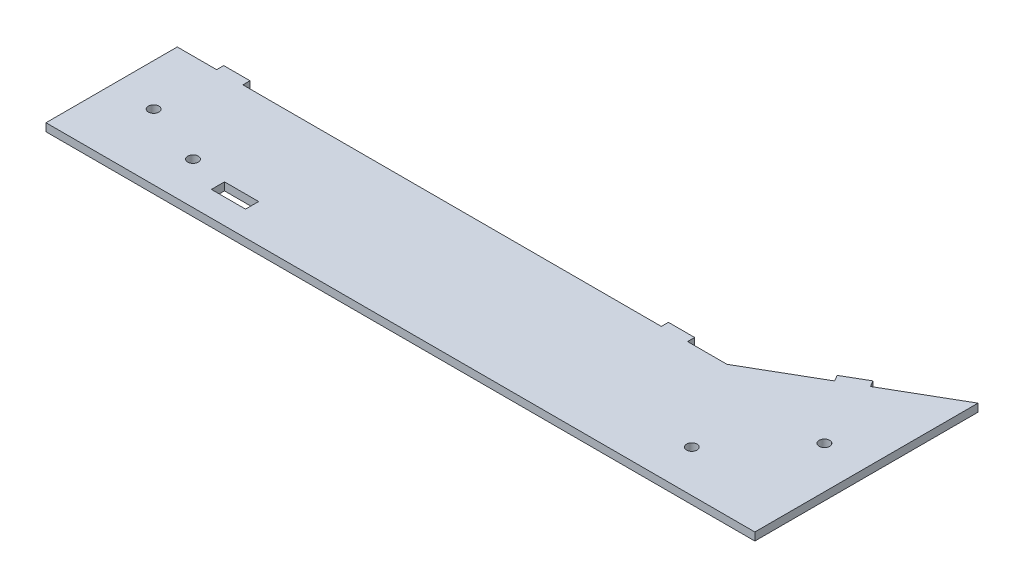
ISO-10303-21;
HEADER;
FILE_DESCRIPTION(('STEP AP214'),'2;1');
FILE_NAME('part.step','',(''),(''),'','','');
FILE_SCHEMA(('AUTOMOTIVE_DESIGN { 1 0 10303 214 1 1 1 1 }'));
ENDSEC;
DATA;
#1=APPLICATION_CONTEXT('core data for automotive mechanical design processes');
#2=APPLICATION_PROTOCOL_DEFINITION('international standard','automotive_design',2000,#1);
#3=PRODUCT_CONTEXT('',#1,'mechanical');
#4=PRODUCT('Part','Part','',(#3));
#5=PRODUCT_RELATED_PRODUCT_CATEGORY('part','',(#4));
#6=PRODUCT_DEFINITION_FORMATION('','',#4);
#7=PRODUCT_DEFINITION_CONTEXT('part definition',#1,'design');
#8=PRODUCT_DEFINITION('design','',#6,#7);
#9=PRODUCT_DEFINITION_SHAPE('','',#8);
#10=(LENGTH_UNIT() NAMED_UNIT(*) SI_UNIT(.MILLI.,.METRE.));
#11=(NAMED_UNIT(*) PLANE_ANGLE_UNIT() SI_UNIT($,.RADIAN.));
#12=(NAMED_UNIT(*) SI_UNIT($,.STERADIAN.) SOLID_ANGLE_UNIT());
#13=UNCERTAINTY_MEASURE_WITH_UNIT(LENGTH_MEASURE(1.E-05),#10,'distance_accuracy_value','');
#14=(GEOMETRIC_REPRESENTATION_CONTEXT(3) GLOBAL_UNCERTAINTY_ASSIGNED_CONTEXT((#13)) GLOBAL_UNIT_ASSIGNED_CONTEXT((#10,
#11,#12)) REPRESENTATION_CONTEXT('',''));
#15=CARTESIAN_POINT('',(0.,0.,0.));
#16=DIRECTION('',(0.,0.,1.));
#17=DIRECTION('',(1.,0.,0.));
#18=AXIS2_PLACEMENT_3D('',#15,#16,#17);
#19=CARTESIAN_POINT('',(101.124303581852,3.,-66.2732771144719));
#20=DIRECTION('',(0.500000000000001,0.,0.866025403784438));
#21=DIRECTION('',(0.866025403784438,0.,-0.500000000000001));
#22=AXIS2_PLACEMENT_3D('',#19,#20,#21);
#23=PLANE('',#22);
#24=DIRECTION('',(0.,-1.,0.));
#25=VECTOR('',#24,1.);
#26=CARTESIAN_POINT('',(75.1435414683194,3.,-51.2732771144718));
#27=LINE('',#26,#25);
#28=CARTESIAN_POINT('',(75.1435414683194,3.,-51.2732771144718));
#29=VERTEX_POINT('',#28);
#30=CARTESIAN_POINT('',(75.1435414683194,0.,-51.2732771144718));
#31=VERTEX_POINT('',#30);
#32=EDGE_CURVE('E189',#29,#31,#27,.T.);
#33=ORIENTED_EDGE('',*,*,#32,.F.);
#34=DIRECTION('',(-0.866025403784438,0.,0.500000000000001));
#35=VECTOR('',#34,1.);
#36=CARTESIAN_POINT('',(101.124303581852,3.,-66.2732771144719));
#37=LINE('',#36,#35);
#38=CARTESIAN_POINT('',(101.124303581852,3.,-66.2732771144719));
#39=VERTEX_POINT('',#38);
#40=EDGE_CURVE('E322',#39,#29,#37,.T.);
#41=ORIENTED_EDGE('',*,*,#40,.F.);
#42=DIRECTION('',(0.,-1.,0.));
#43=VECTOR('',#42,1.);
#44=CARTESIAN_POINT('',(101.124303581852,3.,-66.2732771144719));
#45=LINE('',#44,#43);
#46=CARTESIAN_POINT('',(101.124303581852,0.,-66.2732771144719));
#47=VERTEX_POINT('',#46);
#48=EDGE_CURVE('E339',#39,#47,#45,.T.);
#49=ORIENTED_EDGE('',*,*,#48,.T.);
#50=DIRECTION('',(-0.866025403784438,0.,0.500000000000001));
#51=VECTOR('',#50,1.);
#52=CARTESIAN_POINT('',(101.124303581852,0.,-66.2732771144719));
#53=LINE('',#52,#51);
#54=EDGE_CURVE('E340',#47,#31,#53,.T.);
#55=ORIENTED_EDGE('',*,*,#54,.T.);
#56=EDGE_LOOP('',(#33,#41,#49,#55));
#57=FACE_BOUND('',#56,.T.);
#58=ADVANCED_FACE('F33',(#57),#23,.F.);
#59=DIRECTION('',(0.,1.,0.));
#60=VECTOR('',#59,1.);
#61=CARTESIAN_POINT('',(66.483287430475,3.,-46.2732771144718));
#62=LINE('',#61,#60);
#63=CARTESIAN_POINT('',(66.483287430475,0.,-46.2732771144718));
#64=VERTEX_POINT('',#63);
#65=CARTESIAN_POINT('',(66.483287430475,3.,-46.2732771144718));
#66=VERTEX_POINT('',#65);
#67=EDGE_CURVE('E216',#64,#66,#62,.T.);
#68=ORIENTED_EDGE('',*,*,#67,.F.);
#69=CARTESIAN_POINT('',(40.5025253169418,0.,-31.2732771144718));
#70=VERTEX_POINT('',#69);
#71=EDGE_CURVE('E321',#64,#70,#53,.T.);
#72=ORIENTED_EDGE('',*,*,#71,.T.);
#73=DIRECTION('',(0.,-1.,0.));
#74=VECTOR('',#73,1.);
#75=CARTESIAN_POINT('',(40.5025253169418,3.,-31.2732771144718));
#76=LINE('',#75,#74);
#77=CARTESIAN_POINT('',(40.5025253169418,3.,-31.2732771144718));
#78=VERTEX_POINT('',#77);
#79=EDGE_CURVE('E11',#78,#70,#76,.T.);
#80=ORIENTED_EDGE('',*,*,#79,.F.);
#81=EDGE_CURVE('E326',#66,#78,#37,.T.);
#82=ORIENTED_EDGE('',*,*,#81,.F.);
#83=EDGE_LOOP('',(#68,#72,#80,#82));
#84=FACE_BOUND('',#83,.T.);
#85=ADVANCED_FACE('F397',(#84),#23,.F.);
#86=CARTESIAN_POINT('',(40.5025253169418,3.,-31.2732771144718));
#87=DIRECTION('',(0.,0.,1.));
#88=DIRECTION('',(1.,0.,0.));
#89=AXIS2_PLACEMENT_3D('',#86,#87,#88);
#90=PLANE('',#89);
#91=DIRECTION('',(-1.,0.,0.));
#92=VECTOR('',#91,1.);
#93=CARTESIAN_POINT('',(40.5025253169418,0.,-31.2732771144718));
#94=LINE('',#93,#92);
#95=CARTESIAN_POINT('',(25.5025253169418,0.,-31.2732771144718));
#96=VERTEX_POINT('',#95);
#97=EDGE_CURVE('E343',#70,#96,#94,.T.);
#98=ORIENTED_EDGE('',*,*,#97,.T.);
#99=DIRECTION('',(0.,1.,0.));
#100=VECTOR('',#99,1.);
#101=CARTESIAN_POINT('',(25.5025253169418,3.,-31.2732771144718));
#102=LINE('',#101,#100);
#103=CARTESIAN_POINT('',(25.5025253169418,3.,-31.2732771144718));
#104=VERTEX_POINT('',#103);
#105=EDGE_CURVE('E238',#96,#104,#102,.T.);
#106=ORIENTED_EDGE('',*,*,#105,.T.);
#107=DIRECTION('',(-1.,0.,0.));
#108=VECTOR('',#107,1.);
#109=CARTESIAN_POINT('',(40.5025253169418,3.,-31.2732771144718));
#110=LINE('',#109,#108);
#111=EDGE_CURVE('E327',#78,#104,#110,.T.);
#112=ORIENTED_EDGE('',*,*,#111,.F.);
#113=ORIENTED_EDGE('',*,*,#79,.T.);
#114=EDGE_LOOP('',(#98,#106,#112,#113));
#115=FACE_BOUND('',#114,.T.);
#116=ADVANCED_FACE('F401',(#115),#90,.F.);
#117=CARTESIAN_POINT('',(15.5025253169418,3.,-31.2732771144718));
#118=VERTEX_POINT('',#117);
#119=CARTESIAN_POINT('',(-143.875696418148,3.,-31.2732771144717));
#120=VERTEX_POINT('',#119);
#121=EDGE_CURVE('E331',#118,#120,#110,.T.);
#122=ORIENTED_EDGE('',*,*,#121,.F.);
#123=DIRECTION('',(0.,-1.,0.));
#124=VECTOR('',#123,1.);
#125=CARTESIAN_POINT('',(15.5025253169418,3.,-31.2732771144718));
#126=LINE('',#125,#124);
#127=CARTESIAN_POINT('',(15.5025253169418,0.,-31.2732771144718));
#128=VERTEX_POINT('',#127);
#129=EDGE_CURVE('E243',#118,#128,#126,.T.);
#130=ORIENTED_EDGE('',*,*,#129,.T.);
#131=CARTESIAN_POINT('',(-143.875696418148,0.,-31.2732771144717));
#132=VERTEX_POINT('',#131);
#133=EDGE_CURVE('E346',#128,#132,#94,.T.);
#134=ORIENTED_EDGE('',*,*,#133,.T.);
#135=DIRECTION('',(0.,1.,0.));
#136=VECTOR('',#135,1.);
#137=CARTESIAN_POINT('',(-143.875696418148,3.,-31.2732771144718));
#138=LINE('',#137,#136);
#139=EDGE_CURVE('E259',#132,#120,#138,.T.);
#140=ORIENTED_EDGE('',*,*,#139,.T.);
#141=EDGE_LOOP('',(#122,#130,#134,#140));
#142=FACE_BOUND('',#141,.T.);
#143=ADVANCED_FACE('F415',(#142),#90,.F.);
#144=CARTESIAN_POINT('',(-153.875696418148,3.,-31.2732771144717));
#145=VERTEX_POINT('',#144);
#146=CARTESIAN_POINT('',(-168.875696418148,3.,-31.2732771144717));
#147=VERTEX_POINT('',#146);
#148=EDGE_CURVE('E325',#145,#147,#110,.T.);
#149=ORIENTED_EDGE('',*,*,#148,.F.);
#150=DIRECTION('',(0.,-1.,0.));
#151=VECTOR('',#150,1.);
#152=CARTESIAN_POINT('',(-153.875696418148,3.,-31.2732771144718));
#153=LINE('',#152,#151);
#154=CARTESIAN_POINT('',(-153.875696418148,0.,-31.2732771144718));
#155=VERTEX_POINT('',#154);
#156=EDGE_CURVE('E272',#145,#155,#153,.T.);
#157=ORIENTED_EDGE('',*,*,#156,.T.);
#158=CARTESIAN_POINT('',(-168.875696418148,0.,-31.2732771144717));
#159=VERTEX_POINT('',#158);
#160=EDGE_CURVE('E342',#155,#159,#94,.T.);
#161=ORIENTED_EDGE('',*,*,#160,.T.);
#162=DIRECTION('',(0.,-1.,0.));
#163=VECTOR('',#162,1.);
#164=CARTESIAN_POINT('',(-168.875696418148,3.,-31.2732771144717));
#165=LINE('',#164,#163);
#166=EDGE_CURVE('E40',#147,#159,#165,.T.);
#167=ORIENTED_EDGE('',*,*,#166,.F.);
#168=EDGE_LOOP('',(#149,#157,#161,#167));
#169=FACE_BOUND('',#168,.T.);
#170=ADVANCED_FACE('F418',(#169),#90,.F.);
#171=CARTESIAN_POINT('',(-168.875696418148,3.,-31.2732771144717));
#172=DIRECTION('',(1.,0.,0.));
#173=DIRECTION('',(0.,0.,-1.));
#174=AXIS2_PLACEMENT_3D('',#171,#172,#173);
#175=PLANE('',#174);
#176=DIRECTION('',(0.,0.,1.));
#177=VECTOR('',#176,1.);
#178=CARTESIAN_POINT('',(-168.875696418148,0.,-31.2732771144717));
#179=LINE('',#178,#177);
#180=CARTESIAN_POINT('',(-168.875696418148,0.,18.7267228855283));
#181=VERTEX_POINT('',#180);
#182=EDGE_CURVE('E345',#159,#181,#179,.T.);
#183=ORIENTED_EDGE('',*,*,#182,.T.);
#184=DIRECTION('',(0.,-1.,0.));
#185=VECTOR('',#184,1.);
#186=CARTESIAN_POINT('',(-168.875696418148,3.,18.7267228855283));
#187=LINE('',#186,#185);
#188=CARTESIAN_POINT('',(-168.875696418148,3.,18.7267228855283));
#189=VERTEX_POINT('',#188);
#190=EDGE_CURVE('E359',#189,#181,#187,.T.);
#191=ORIENTED_EDGE('',*,*,#190,.F.);
#192=DIRECTION('',(0.,0.,1.));
#193=VECTOR('',#192,1.);
#194=CARTESIAN_POINT('',(-168.875696418148,3.,-31.2732771144717));
#195=LINE('',#194,#193);
#196=EDGE_CURVE('E330',#147,#189,#195,.T.);
#197=ORIENTED_EDGE('',*,*,#196,.F.);
#198=ORIENTED_EDGE('',*,*,#166,.T.);
#199=EDGE_LOOP('',(#183,#191,#197,#198));
#200=FACE_BOUND('',#199,.T.);
#201=ADVANCED_FACE('F365',(#200),#175,.F.);
#202=CARTESIAN_POINT('',(101.124303581852,3.,18.7267228855282));
#203=DIRECTION('',(0.,0.,1.));
#204=DIRECTION('',(1.,0.,0.));
#205=AXIS2_PLACEMENT_3D('',#202,#203,#204);
#206=PLANE('',#205);
#207=DIRECTION('',(-1.,0.,0.));
#208=VECTOR('',#207,1.);
#209=CARTESIAN_POINT('',(101.124303581852,0.,18.7267228855282));
#210=LINE('',#209,#208);
#211=CARTESIAN_POINT('',(101.124303581852,0.,18.7267228855282));
#212=VERTEX_POINT('',#211);
#213=EDGE_CURVE('E349',#212,#181,#210,.T.);
#214=ORIENTED_EDGE('',*,*,#213,.F.);
#215=DIRECTION('',(0.,-1.,0.));
#216=VECTOR('',#215,1.);
#217=CARTESIAN_POINT('',(101.124303581852,3.,18.7267228855282));
#218=LINE('',#217,#216);
#219=CARTESIAN_POINT('',(101.124303581852,3.,18.7267228855282));
#220=VERTEX_POINT('',#219);
#221=EDGE_CURVE('E356',#220,#212,#218,.T.);
#222=ORIENTED_EDGE('',*,*,#221,.F.);
#223=DIRECTION('',(-1.,0.,0.));
#224=VECTOR('',#223,1.);
#225=CARTESIAN_POINT('',(101.124303581852,3.,18.7267228855282));
#226=LINE('',#225,#224);
#227=EDGE_CURVE('E333',#220,#189,#226,.T.);
#228=ORIENTED_EDGE('',*,*,#227,.T.);
#229=ORIENTED_EDGE('',*,*,#190,.T.);
#230=EDGE_LOOP('',(#214,#222,#228,#229));
#231=FACE_BOUND('',#230,.T.);
#232=ADVANCED_FACE('F372',(#231),#206,.T.);
#233=CARTESIAN_POINT('',(101.124303581852,3.,-11.2137320546137));
#234=DIRECTION('',(-1.,0.,0.));
#235=DIRECTION('',(0.,0.,1.));
#236=AXIS2_PLACEMENT_3D('',#233,#234,#235);
#237=PLANE('',#236);
#238=DIRECTION('',(0.,0.,-1.));
#239=VECTOR('',#238,1.);
#240=CARTESIAN_POINT('',(101.124303581852,0.,-11.2137320546137));
#241=LINE('',#240,#239);
#242=EDGE_CURVE('E352',#212,#47,#241,.T.);
#243=ORIENTED_EDGE('',*,*,#242,.T.);
#244=ORIENTED_EDGE('',*,*,#48,.F.);
#245=DIRECTION('',(0.,0.,1.));
#246=VECTOR('',#245,1.);
#247=CARTESIAN_POINT('',(101.124303581852,3.,-11.2137320546137));
#248=LINE('',#247,#246);
#249=EDGE_CURVE('E336',#39,#220,#248,.T.);
#250=ORIENTED_EDGE('',*,*,#249,.T.);
#251=ORIENTED_EDGE('',*,*,#221,.T.);
#252=EDGE_LOOP('',(#243,#244,#250,#251));
#253=FACE_BOUND('',#252,.T.);
#254=ADVANCED_FACE('F378',(#253),#237,.F.);
#255=CARTESIAN_POINT('',(0.,3.,0.));
#256=DIRECTION('',(0.,1.,0.));
#257=DIRECTION('',(0.,0.,1.));
#258=AXIS2_PLACEMENT_3D('',#255,#256,#257);
#259=PLANE('',#258);
#260=DIRECTION('',(0.,0.,-1.));
#261=VECTOR('',#260,1.);
#262=CARTESIAN_POINT('',(-102.375696418148,3.,4.2267228855282));
#263=LINE('',#262,#261);
#264=CARTESIAN_POINT('',(-102.375696418148,3.,9.2267228855282));
#265=VERTEX_POINT('',#264);
#266=CARTESIAN_POINT('',(-102.375696418148,3.,4.2267228855282));
#267=VERTEX_POINT('',#266);
#268=EDGE_CURVE('E47',#265,#267,#263,.T.);
#269=ORIENTED_EDGE('',*,*,#268,.F.);
#270=DIRECTION('',(1.,0.,0.));
#271=VECTOR('',#270,1.);
#272=CARTESIAN_POINT('',(-115.375696418148,3.,9.2267228855282));
#273=LINE('',#272,#271);
#274=CARTESIAN_POINT('',(-115.375696418148,3.,9.2267228855282));
#275=VERTEX_POINT('',#274);
#276=EDGE_CURVE('E183',#275,#265,#273,.T.);
#277=ORIENTED_EDGE('',*,*,#276,.F.);
#278=DIRECTION('',(0.,0.,1.));
#279=VECTOR('',#278,1.);
#280=CARTESIAN_POINT('',(-115.375696418148,3.,4.2267228855282));
#281=LINE('',#280,#279);
#282=CARTESIAN_POINT('',(-115.375696418148,3.,4.2267228855282));
#283=VERTEX_POINT('',#282);
#284=EDGE_CURVE('E203',#283,#275,#281,.T.);
#285=ORIENTED_EDGE('',*,*,#284,.F.);
#286=DIRECTION('',(-1.,0.,0.));
#287=VECTOR('',#286,1.);
#288=CARTESIAN_POINT('',(-115.375696418148,3.,4.2267228855282));
#289=LINE('',#288,#287);
#290=EDGE_CURVE('E197',#267,#283,#289,.T.);
#291=ORIENTED_EDGE('',*,*,#290,.F.);
#292=EDGE_LOOP('',(#269,#277,#285,#291));
#293=FACE_BOUND('',#292,.T.);
#294=CARTESIAN_POINT('',(61.1243035818525,3.,2.7267228855282));
#295=DIRECTION('',(0.,1.,0.));
#296=DIRECTION('',(0.,0.,1.));
#297=AXIS2_PLACEMENT_3D('',#294,#295,#296);
#298=CIRCLE('',#297,1.99999999999999);
#299=CARTESIAN_POINT('',(61.1243035818525,3.,4.72672288552819));
#300=VERTEX_POINT('',#299);
#301=EDGE_CURVE('E289',#300,#300,#298,.T.);
#302=ORIENTED_EDGE('',*,*,#301,.F.);
#303=EDGE_LOOP('',(#302));
#304=FACE_BOUND('',#303,.T.);
#305=CARTESIAN_POINT('',(-128.875696418148,3.,2.7267228855282));
#306=DIRECTION('',(0.,1.,0.));
#307=DIRECTION('',(0.,0.,1.));
#308=AXIS2_PLACEMENT_3D('',#305,#306,#307);
#309=CIRCLE('',#308,2.);
#310=CARTESIAN_POINT('',(-128.875696418148,3.,4.7267228855282));
#311=VERTEX_POINT('',#310);
#312=EDGE_CURVE('E303',#311,#311,#309,.T.);
#313=ORIENTED_EDGE('',*,*,#312,.F.);
#314=EDGE_LOOP('',(#313));
#315=FACE_BOUND('',#314,.T.);
#316=CARTESIAN_POINT('',(85.1243035818525,3.,-23.7732771144718));
#317=DIRECTION('',(0.,1.,0.));
#318=DIRECTION('',(0.,0.,1.));
#319=AXIS2_PLACEMENT_3D('',#316,#317,#318);
#320=CIRCLE('',#319,2.);
#321=CARTESIAN_POINT('',(85.1243035818525,3.,-21.7732771144718));
#322=VERTEX_POINT('',#321);
#323=EDGE_CURVE('E312',#322,#322,#320,.T.);
#324=ORIENTED_EDGE('',*,*,#323,.F.);
#325=EDGE_LOOP('',(#324));
#326=FACE_BOUND('',#325,.T.);
#327=CARTESIAN_POINT('',(-152.875696418148,3.,-6.27327711447171));
#328=DIRECTION('',(0.,1.,0.));
#329=DIRECTION('',(0.,0.,1.));
#330=AXIS2_PLACEMENT_3D('',#327,#328,#329);
#331=CIRCLE('',#330,2.);
#332=CARTESIAN_POINT('',(-152.875696418148,3.,-4.27327711447172));
#333=VERTEX_POINT('',#332);
#334=EDGE_CURVE('E315',#333,#333,#331,.T.);
#335=ORIENTED_EDGE('',*,*,#334,.F.);
#336=EDGE_LOOP('',(#335));
#337=FACE_BOUND('',#336,.T.);
#338=ORIENTED_EDGE('',*,*,#40,.T.);
#339=DIRECTION('',(0.500000000000001,0.,0.866025403784438));
#340=VECTOR('',#339,1.);
#341=CARTESIAN_POINT('',(73.7935414683194,3.,-53.6115457046898));
#342=LINE('',#341,#340);
#343=CARTESIAN_POINT('',(73.7935414683194,3.,-53.6115457046898));
#344=VERTEX_POINT('',#343);
#345=EDGE_CURVE('E222',#344,#29,#342,.T.);
#346=ORIENTED_EDGE('',*,*,#345,.F.);
#347=DIRECTION('',(0.866025403784439,0.,-0.5));
#348=VECTOR('',#347,1.);
#349=CARTESIAN_POINT('',(73.7935414683194,3.,-53.6115457046898));
#350=LINE('',#349,#348);
#351=CARTESIAN_POINT('',(65.133287430475,3.,-48.6115457046898));
#352=VERTEX_POINT('',#351);
#353=EDGE_CURVE('E220',#352,#344,#350,.T.);
#354=ORIENTED_EDGE('',*,*,#353,.F.);
#355=DIRECTION('',(0.500000000000001,0.,0.866025403784438));
#356=VECTOR('',#355,1.);
#357=CARTESIAN_POINT('',(65.133287430475,3.,-48.6115457046898));
#358=LINE('',#357,#356);
#359=EDGE_CURVE('E229',#352,#66,#358,.T.);
#360=ORIENTED_EDGE('',*,*,#359,.T.);
#361=ORIENTED_EDGE('',*,*,#81,.T.);
#362=ORIENTED_EDGE('',*,*,#111,.T.);
#363=DIRECTION('',(0.,0.,1.));
#364=VECTOR('',#363,1.);
#365=CARTESIAN_POINT('',(25.5025253169418,3.,-33.9732771144718));
#366=LINE('',#365,#364);
#367=CARTESIAN_POINT('',(25.5025253169418,3.,-33.9732771144718));
#368=VERTEX_POINT('',#367);
#369=EDGE_CURVE('E252',#368,#104,#366,.T.);
#370=ORIENTED_EDGE('',*,*,#369,.F.);
#371=DIRECTION('',(-1.,0.,0.));
#372=VECTOR('',#371,1.);
#373=CARTESIAN_POINT('',(25.5025253169418,3.,-33.9732771144718));
#374=LINE('',#373,#372);
#375=CARTESIAN_POINT('',(15.5025253169418,3.,-33.9732771144718));
#376=VERTEX_POINT('',#375);
#377=EDGE_CURVE('E242',#368,#376,#374,.T.);
#378=ORIENTED_EDGE('',*,*,#377,.T.);
#379=DIRECTION('',(0.,0.,1.));
#380=VECTOR('',#379,1.);
#381=CARTESIAN_POINT('',(15.5025253169418,3.,-33.9732771144718));
#382=LINE('',#381,#380);
#383=EDGE_CURVE('E263',#376,#118,#382,.T.);
#384=ORIENTED_EDGE('',*,*,#383,.T.);
#385=ORIENTED_EDGE('',*,*,#121,.T.);
#386=DIRECTION('',(0.,0.,1.));
#387=VECTOR('',#386,1.);
#388=CARTESIAN_POINT('',(-143.875696418148,3.,-33.9732771144718));
#389=LINE('',#388,#387);
#390=CARTESIAN_POINT('',(-143.875696418148,3.,-33.9732771144718));
#391=VERTEX_POINT('',#390);
#392=EDGE_CURVE('E281',#391,#120,#389,.T.);
#393=ORIENTED_EDGE('',*,*,#392,.F.);
#394=DIRECTION('',(-1.,0.,0.));
#395=VECTOR('',#394,1.);
#396=CARTESIAN_POINT('',(-143.875696418148,3.,-33.9732771144718));
#397=LINE('',#396,#395);
#398=CARTESIAN_POINT('',(-153.875696418148,3.,-33.9732771144718));
#399=VERTEX_POINT('',#398);
#400=EDGE_CURVE('E271',#391,#399,#397,.T.);
#401=ORIENTED_EDGE('',*,*,#400,.T.);
#402=DIRECTION('',(0.,0.,1.));
#403=VECTOR('',#402,1.);
#404=CARTESIAN_POINT('',(-153.875696418148,3.,-33.9732771144718));
#405=LINE('',#404,#403);
#406=EDGE_CURVE('E293',#399,#145,#405,.T.);
#407=ORIENTED_EDGE('',*,*,#406,.T.);
#408=ORIENTED_EDGE('',*,*,#148,.T.);
#409=ORIENTED_EDGE('',*,*,#196,.T.);
#410=ORIENTED_EDGE('',*,*,#227,.F.);
#411=ORIENTED_EDGE('',*,*,#249,.F.);
#412=EDGE_LOOP('',(#338,#346,#354,#360,#361,#362,#370,#378,#384,#385,#393,#401,#407,#408,#409,
#410,#411));
#413=FACE_BOUND('',#412,.T.);
#414=ADVANCED_FACE('F375',(#293,#304,#315,#326,#337,#413),#259,.T.);
#415=CARTESIAN_POINT('',(0.,0.,0.));
#416=DIRECTION('',(0.,1.,0.));
#417=DIRECTION('',(0.,0.,1.));
#418=AXIS2_PLACEMENT_3D('',#415,#416,#417);
#419=PLANE('',#418);
#420=DIRECTION('',(-1.,0.,0.));
#421=VECTOR('',#420,1.);
#422=CARTESIAN_POINT('',(-115.375696418148,0.,9.2267228855282));
#423=LINE('',#422,#421);
#424=CARTESIAN_POINT('',(-102.375696418148,0.,9.2267228855282));
#425=VERTEX_POINT('',#424);
#426=CARTESIAN_POINT('',(-115.375696418148,0.,9.2267228855282));
#427=VERTEX_POINT('',#426);
#428=EDGE_CURVE('E195',#425,#427,#423,.T.);
#429=ORIENTED_EDGE('',*,*,#428,.F.);
#430=DIRECTION('',(0.,0.,1.));
#431=VECTOR('',#430,1.);
#432=CARTESIAN_POINT('',(-102.375696418148,0.,4.2267228855282));
#433=LINE('',#432,#431);
#434=CARTESIAN_POINT('',(-102.375696418148,0.,4.2267228855282));
#435=VERTEX_POINT('',#434);
#436=EDGE_CURVE('E177',#435,#425,#433,.T.);
#437=ORIENTED_EDGE('',*,*,#436,.F.);
#438=DIRECTION('',(1.,0.,0.));
#439=VECTOR('',#438,1.);
#440=CARTESIAN_POINT('',(-115.375696418148,0.,4.2267228855282));
#441=LINE('',#440,#439);
#442=CARTESIAN_POINT('',(-115.375696418148,0.,4.2267228855282));
#443=VERTEX_POINT('',#442);
#444=EDGE_CURVE('E186',#443,#435,#441,.T.);
#445=ORIENTED_EDGE('',*,*,#444,.F.);
#446=DIRECTION('',(0.,0.,-1.));
#447=VECTOR('',#446,1.);
#448=CARTESIAN_POINT('',(-115.375696418148,0.,4.2267228855282));
#449=LINE('',#448,#447);
#450=EDGE_CURVE('E55',#427,#443,#449,.T.);
#451=ORIENTED_EDGE('',*,*,#450,.F.);
#452=EDGE_LOOP('',(#429,#437,#445,#451));
#453=FACE_BOUND('',#452,.T.);
#454=CARTESIAN_POINT('',(61.1243035818525,0.,2.7267228855282));
#455=DIRECTION('',(0.,1.,0.));
#456=DIRECTION('',(0.,0.,1.));
#457=AXIS2_PLACEMENT_3D('',#454,#455,#456);
#458=CIRCLE('',#457,1.99999999999999);
#459=CARTESIAN_POINT('',(61.1243035818525,0.,4.72672288552819));
#460=VERTEX_POINT('',#459);
#461=EDGE_CURVE('E300',#460,#460,#458,.F.);
#462=ORIENTED_EDGE('',*,*,#461,.F.);
#463=EDGE_LOOP('',(#462));
#464=FACE_BOUND('',#463,.T.);
#465=CARTESIAN_POINT('',(-128.875696418148,0.,2.7267228855282));
#466=DIRECTION('',(0.,1.,0.));
#467=DIRECTION('',(0.,0.,1.));
#468=AXIS2_PLACEMENT_3D('',#465,#466,#467);
#469=CIRCLE('',#468,2.);
#470=CARTESIAN_POINT('',(-128.875696418148,0.,4.7267228855282));
#471=VERTEX_POINT('',#470);
#472=EDGE_CURVE('E306',#471,#471,#469,.F.);
#473=ORIENTED_EDGE('',*,*,#472,.F.);
#474=EDGE_LOOP('',(#473));
#475=FACE_BOUND('',#474,.T.);
#476=CARTESIAN_POINT('',(85.1243035818525,0.,-23.7732771144718));
#477=DIRECTION('',(0.,1.,0.));
#478=DIRECTION('',(0.,0.,1.));
#479=AXIS2_PLACEMENT_3D('',#476,#477,#478);
#480=CIRCLE('',#479,2.);
#481=CARTESIAN_POINT('',(85.1243035818525,0.,-21.7732771144718));
#482=VERTEX_POINT('',#481);
#483=EDGE_CURVE('E309',#482,#482,#480,.F.);
#484=ORIENTED_EDGE('',*,*,#483,.F.);
#485=EDGE_LOOP('',(#484));
#486=FACE_BOUND('',#485,.T.);
#487=CARTESIAN_POINT('',(-152.875696418148,0.,-6.27327711447171));
#488=DIRECTION('',(0.,1.,0.));
#489=DIRECTION('',(0.,0.,1.));
#490=AXIS2_PLACEMENT_3D('',#487,#488,#489);
#491=CIRCLE('',#490,2.);
#492=CARTESIAN_POINT('',(-152.875696418148,0.,-4.27327711447172));
#493=VERTEX_POINT('',#492);
#494=EDGE_CURVE('E318',#493,#493,#491,.F.);
#495=ORIENTED_EDGE('',*,*,#494,.F.);
#496=EDGE_LOOP('',(#495));
#497=FACE_BOUND('',#496,.T.);
#498=ORIENTED_EDGE('',*,*,#54,.F.);
#499=ORIENTED_EDGE('',*,*,#242,.F.);
#500=ORIENTED_EDGE('',*,*,#213,.T.);
#501=ORIENTED_EDGE('',*,*,#182,.F.);
#502=ORIENTED_EDGE('',*,*,#160,.F.);
#503=DIRECTION('',(0.,0.,1.));
#504=VECTOR('',#503,1.);
#505=CARTESIAN_POINT('',(-153.875696418148,0.,-33.9732771144718));
#506=LINE('',#505,#504);
#507=CARTESIAN_POINT('',(-153.875696418148,0.,-33.9732771144718));
#508=VERTEX_POINT('',#507);
#509=EDGE_CURVE('E290',#508,#155,#506,.T.);
#510=ORIENTED_EDGE('',*,*,#509,.F.);
#511=DIRECTION('',(1.,0.,0.));
#512=VECTOR('',#511,1.);
#513=CARTESIAN_POINT('',(-143.875696418148,0.,-33.9732771144718));
#514=LINE('',#513,#512);
#515=CARTESIAN_POINT('',(-143.875696418148,0.,-33.9732771144718));
#516=VERTEX_POINT('',#515);
#517=EDGE_CURVE('E278',#508,#516,#514,.T.);
#518=ORIENTED_EDGE('',*,*,#517,.T.);
#519=DIRECTION('',(0.,0.,1.));
#520=VECTOR('',#519,1.);
#521=CARTESIAN_POINT('',(-143.875696418148,0.,-33.9732771144718));
#522=LINE('',#521,#520);
#523=EDGE_CURVE('E286',#516,#132,#522,.T.);
#524=ORIENTED_EDGE('',*,*,#523,.T.);
#525=ORIENTED_EDGE('',*,*,#133,.F.);
#526=DIRECTION('',(0.,0.,1.));
#527=VECTOR('',#526,1.);
#528=CARTESIAN_POINT('',(15.5025253169418,0.,-33.9732771144718));
#529=LINE('',#528,#527);
#530=CARTESIAN_POINT('',(15.5025253169418,0.,-33.9732771144718));
#531=VERTEX_POINT('',#530);
#532=EDGE_CURVE('E260',#531,#128,#529,.T.);
#533=ORIENTED_EDGE('',*,*,#532,.F.);
#534=DIRECTION('',(1.,0.,0.));
#535=VECTOR('',#534,1.);
#536=CARTESIAN_POINT('',(25.5025253169418,0.,-33.9732771144718));
#537=LINE('',#536,#535);
#538=CARTESIAN_POINT('',(25.5025253169418,0.,-33.9732771144718));
#539=VERTEX_POINT('',#538);
#540=EDGE_CURVE('E249',#531,#539,#537,.T.);
#541=ORIENTED_EDGE('',*,*,#540,.T.);
#542=DIRECTION('',(0.,0.,1.));
#543=VECTOR('',#542,1.);
#544=CARTESIAN_POINT('',(25.5025253169418,0.,-33.9732771144718));
#545=LINE('',#544,#543);
#546=EDGE_CURVE('E256',#539,#96,#545,.T.);
#547=ORIENTED_EDGE('',*,*,#546,.T.);
#548=ORIENTED_EDGE('',*,*,#97,.F.);
#549=ORIENTED_EDGE('',*,*,#71,.F.);
#550=DIRECTION('',(0.500000000000001,0.,0.866025403784438));
#551=VECTOR('',#550,1.);
#552=CARTESIAN_POINT('',(65.133287430475,0.,-48.6115457046898));
#553=LINE('',#552,#551);
#554=CARTESIAN_POINT('',(65.133287430475,0.,-48.6115457046898));
#555=VERTEX_POINT('',#554);
#556=EDGE_CURVE('E232',#555,#64,#553,.T.);
#557=ORIENTED_EDGE('',*,*,#556,.F.);
#558=DIRECTION('',(-0.866025403784439,0.,0.5));
#559=VECTOR('',#558,1.);
#560=CARTESIAN_POINT('',(73.7935414683194,0.,-53.6115457046898));
#561=LINE('',#560,#559);
#562=CARTESIAN_POINT('',(73.7935414683194,0.,-53.6115457046898));
#563=VERTEX_POINT('',#562);
#564=EDGE_CURVE('E215',#563,#555,#561,.T.);
#565=ORIENTED_EDGE('',*,*,#564,.F.);
#566=DIRECTION('',(0.500000000000001,0.,0.866025403784438));
#567=VECTOR('',#566,1.);
#568=CARTESIAN_POINT('',(73.7935414683194,0.,-53.6115457046898));
#569=LINE('',#568,#567);
#570=EDGE_CURVE('E235',#563,#31,#569,.T.);
#571=ORIENTED_EDGE('',*,*,#570,.T.);
#572=EDGE_LOOP('',(#498,#499,#500,#501,#502,#510,#518,#524,#525,#533,#541,#547,#548,#549,#557,
#565,#571));
#573=FACE_BOUND('',#572,.T.);
#574=ADVANCED_FACE('F192',(#453,#464,#475,#486,#497,#573),#419,.F.);
#575=CARTESIAN_POINT('',(-152.875696418148,-0.00100000000000013,-6.27327711447171));
#576=DIRECTION('',(0.,1.,0.));
#577=DIRECTION('',(0.,0.,1.));
#578=AXIS2_PLACEMENT_3D('',#575,#576,#577);
#579=CYLINDRICAL_SURFACE('',#578,2.);
#580=ORIENTED_EDGE('',*,*,#334,.T.);
#581=EDGE_LOOP('',(#580));
#582=FACE_BOUND('',#581,.T.);
#583=ORIENTED_EDGE('',*,*,#494,.T.);
#584=EDGE_LOOP('',(#583));
#585=FACE_BOUND('',#584,.T.);
#586=ADVANCED_FACE('F464',(#582,#585),#579,.F.);
#587=CARTESIAN_POINT('',(85.1243035818525,-0.00100000000000013,-23.7732771144718));
#588=DIRECTION('',(0.,1.,0.));
#589=DIRECTION('',(0.,0.,1.));
#590=AXIS2_PLACEMENT_3D('',#587,#588,#589);
#591=CYLINDRICAL_SURFACE('',#590,2.);
#592=ORIENTED_EDGE('',*,*,#323,.T.);
#593=EDGE_LOOP('',(#592));
#594=FACE_BOUND('',#593,.T.);
#595=ORIENTED_EDGE('',*,*,#483,.T.);
#596=EDGE_LOOP('',(#595));
#597=FACE_BOUND('',#596,.T.);
#598=ADVANCED_FACE('F470',(#594,#597),#591,.F.);
#599=CARTESIAN_POINT('',(-128.875696418148,-0.00100000000000013,2.7267228855282));
#600=DIRECTION('',(0.,1.,0.));
#601=DIRECTION('',(0.,0.,1.));
#602=AXIS2_PLACEMENT_3D('',#599,#600,#601);
#603=CYLINDRICAL_SURFACE('',#602,2.);
#604=ORIENTED_EDGE('',*,*,#312,.T.);
#605=EDGE_LOOP('',(#604));
#606=FACE_BOUND('',#605,.T.);
#607=ORIENTED_EDGE('',*,*,#472,.T.);
#608=EDGE_LOOP('',(#607));
#609=FACE_BOUND('',#608,.T.);
#610=ADVANCED_FACE('F437',(#606,#609),#603,.F.);
#611=CARTESIAN_POINT('',(61.1243035818525,-0.00100000000000013,2.7267228855282));
#612=DIRECTION('',(0.,1.,0.));
#613=DIRECTION('',(0.,0.,1.));
#614=AXIS2_PLACEMENT_3D('',#611,#612,#613);
#615=CYLINDRICAL_SURFACE('',#614,1.99999999999999);
#616=ORIENTED_EDGE('',*,*,#301,.T.);
#617=EDGE_LOOP('',(#616));
#618=FACE_BOUND('',#617,.T.);
#619=ORIENTED_EDGE('',*,*,#461,.T.);
#620=EDGE_LOOP('',(#619));
#621=FACE_BOUND('',#620,.T.);
#622=ADVANCED_FACE('F430',(#618,#621),#615,.F.);
#623=CARTESIAN_POINT('',(-143.875696418148,3.,-33.9732771144718));
#624=DIRECTION('',(1.,0.,0.));
#625=DIRECTION('',(0.,0.,-1.));
#626=AXIS2_PLACEMENT_3D('',#623,#624,#625);
#627=PLANE('',#626);
#628=ORIENTED_EDGE('',*,*,#139,.F.);
#629=ORIENTED_EDGE('',*,*,#523,.F.);
#630=DIRECTION('',(0.,1.,0.));
#631=VECTOR('',#630,1.);
#632=CARTESIAN_POINT('',(-143.875696418148,3.,-33.9732771144718));
#633=LINE('',#632,#631);
#634=EDGE_CURVE('E268',#516,#391,#633,.T.);
#635=ORIENTED_EDGE('',*,*,#634,.T.);
#636=ORIENTED_EDGE('',*,*,#392,.T.);
#637=EDGE_LOOP('',(#628,#629,#635,#636));
#638=FACE_BOUND('',#637,.T.);
#639=ADVANCED_FACE('F428',(#638),#627,.T.);
#640=CARTESIAN_POINT('',(-153.875696418148,3.,-33.9732771144718));
#641=DIRECTION('',(-1.,0.,0.));
#642=DIRECTION('',(0.,0.,1.));
#643=AXIS2_PLACEMENT_3D('',#640,#641,#642);
#644=PLANE('',#643);
#645=ORIENTED_EDGE('',*,*,#156,.F.);
#646=ORIENTED_EDGE('',*,*,#406,.F.);
#647=DIRECTION('',(0.,-1.,0.));
#648=VECTOR('',#647,1.);
#649=CARTESIAN_POINT('',(-153.875696418148,3.,-33.9732771144718));
#650=LINE('',#649,#648);
#651=EDGE_CURVE('E275',#399,#508,#650,.T.);
#652=ORIENTED_EDGE('',*,*,#651,.T.);
#653=ORIENTED_EDGE('',*,*,#509,.T.);
#654=EDGE_LOOP('',(#645,#646,#652,#653));
#655=FACE_BOUND('',#654,.T.);
#656=ADVANCED_FACE('F420',(#655),#644,.T.);
#657=CARTESIAN_POINT('',(0.,0.,-33.9732771144718));
#658=DIRECTION('',(0.,0.,-1.));
#659=DIRECTION('',(-1.,0.,0.));
#660=AXIS2_PLACEMENT_3D('',#657,#658,#659);
#661=PLANE('',#660);
#662=ORIENTED_EDGE('',*,*,#634,.F.);
#663=ORIENTED_EDGE('',*,*,#517,.F.);
#664=ORIENTED_EDGE('',*,*,#651,.F.);
#665=ORIENTED_EDGE('',*,*,#400,.F.);
#666=EDGE_LOOP('',(#662,#663,#664,#665));
#667=FACE_BOUND('',#666,.T.);
#668=ADVANCED_FACE('F425',(#667),#661,.T.);
#669=CARTESIAN_POINT('',(25.5025253169418,3.,-33.9732771144718));
#670=DIRECTION('',(1.,0.,0.));
#671=DIRECTION('',(0.,0.,-1.));
#672=AXIS2_PLACEMENT_3D('',#669,#670,#671);
#673=PLANE('',#672);
#674=ORIENTED_EDGE('',*,*,#105,.F.);
#675=ORIENTED_EDGE('',*,*,#546,.F.);
#676=DIRECTION('',(0.,1.,0.));
#677=VECTOR('',#676,1.);
#678=CARTESIAN_POINT('',(25.5025253169418,3.,-33.9732771144718));
#679=LINE('',#678,#677);
#680=EDGE_CURVE('E239',#539,#368,#679,.T.);
#681=ORIENTED_EDGE('',*,*,#680,.T.);
#682=ORIENTED_EDGE('',*,*,#369,.T.);
#683=EDGE_LOOP('',(#674,#675,#681,#682));
#684=FACE_BOUND('',#683,.T.);
#685=ADVANCED_FACE('F405',(#684),#673,.T.);
#686=CARTESIAN_POINT('',(15.5025253169418,3.,-33.9732771144718));
#687=DIRECTION('',(-1.,0.,0.));
#688=DIRECTION('',(0.,-1.,0.));
#689=AXIS2_PLACEMENT_3D('',#686,#687,#688);
#690=PLANE('',#689);
#691=ORIENTED_EDGE('',*,*,#129,.F.);
#692=ORIENTED_EDGE('',*,*,#383,.F.);
#693=DIRECTION('',(0.,-1.,0.));
#694=VECTOR('',#693,1.);
#695=CARTESIAN_POINT('',(15.5025253169418,3.,-33.9732771144718));
#696=LINE('',#695,#694);
#697=EDGE_CURVE('E246',#376,#531,#696,.T.);
#698=ORIENTED_EDGE('',*,*,#697,.T.);
#699=ORIENTED_EDGE('',*,*,#532,.T.);
#700=EDGE_LOOP('',(#691,#692,#698,#699));
#701=FACE_BOUND('',#700,.T.);
#702=ADVANCED_FACE('F413',(#701),#690,.T.);
#703=CARTESIAN_POINT('',(0.,0.,-33.9732771144718));
#704=DIRECTION('',(0.,0.,-1.));
#705=DIRECTION('',(-1.,0.,0.));
#706=AXIS2_PLACEMENT_3D('',#703,#704,#705);
#707=PLANE('',#706);
#708=ORIENTED_EDGE('',*,*,#680,.F.);
#709=ORIENTED_EDGE('',*,*,#540,.F.);
#710=ORIENTED_EDGE('',*,*,#697,.F.);
#711=ORIENTED_EDGE('',*,*,#377,.F.);
#712=EDGE_LOOP('',(#708,#709,#710,#711));
#713=FACE_BOUND('',#712,.T.);
#714=ADVANCED_FACE('F409',(#713),#707,.T.);
#715=CARTESIAN_POINT('',(73.7935414683194,3.,-53.6115457046898));
#716=DIRECTION('',(-0.866025403784438,0.,0.500000000000001));
#717=DIRECTION('',(0.500000000000001,0.,0.866025403784438));
#718=AXIS2_PLACEMENT_3D('',#715,#716,#717);
#719=PLANE('',#718);
#720=ORIENTED_EDGE('',*,*,#32,.T.);
#721=ORIENTED_EDGE('',*,*,#570,.F.);
#722=DIRECTION('',(0.,-1.,0.));
#723=VECTOR('',#722,1.);
#724=CARTESIAN_POINT('',(73.7935414683194,3.,-53.6115457046898));
#725=LINE('',#724,#723);
#726=EDGE_CURVE('E212',#344,#563,#725,.T.);
#727=ORIENTED_EDGE('',*,*,#726,.F.);
#728=ORIENTED_EDGE('',*,*,#345,.T.);
#729=EDGE_LOOP('',(#720,#721,#727,#728));
#730=FACE_BOUND('',#729,.T.);
#731=ADVANCED_FACE('F385',(#730),#719,.F.);
#732=CARTESIAN_POINT('',(65.133287430475,3.,-48.6115457046898));
#733=DIRECTION('',(0.866025403784438,0.,-0.500000000000001));
#734=DIRECTION('',(-0.500000000000001,0.,-0.866025403784438));
#735=AXIS2_PLACEMENT_3D('',#732,#733,#734);
#736=PLANE('',#735);
#737=ORIENTED_EDGE('',*,*,#67,.T.);
#738=ORIENTED_EDGE('',*,*,#359,.F.);
#739=DIRECTION('',(0.,1.,0.));
#740=VECTOR('',#739,1.);
#741=CARTESIAN_POINT('',(65.133287430475,3.,-48.6115457046898));
#742=LINE('',#741,#740);
#743=EDGE_CURVE('E218',#555,#352,#742,.T.);
#744=ORIENTED_EDGE('',*,*,#743,.F.);
#745=ORIENTED_EDGE('',*,*,#556,.T.);
#746=EDGE_LOOP('',(#737,#738,#744,#745));
#747=FACE_BOUND('',#746,.T.);
#748=ADVANCED_FACE('F394',(#747),#736,.F.);
#749=CARTESIAN_POINT('',(-4.76609489112607,0.,-8.2551185051248));
#750=DIRECTION('',(-0.5,0.,-0.866025403784439));
#751=DIRECTION('',(-0.866025403784439,0.,0.5));
#752=AXIS2_PLACEMENT_3D('',#749,#750,#751);
#753=PLANE('',#752);
#754=ORIENTED_EDGE('',*,*,#726,.T.);
#755=ORIENTED_EDGE('',*,*,#564,.T.);
#756=ORIENTED_EDGE('',*,*,#743,.T.);
#757=ORIENTED_EDGE('',*,*,#353,.T.);
#758=EDGE_LOOP('',(#754,#755,#756,#757));
#759=FACE_BOUND('',#758,.T.);
#760=ADVANCED_FACE('F388',(#759),#753,.T.);
#761=CARTESIAN_POINT('',(-102.375696418148,-0.00100000000000143,4.2267228855282));
#762=DIRECTION('',(1.,0.,0.));
#763=DIRECTION('',(0.,0.,-1.));
#764=AXIS2_PLACEMENT_3D('',#761,#762,#763);
#765=PLANE('',#764);
#766=ORIENTED_EDGE('',*,*,#436,.T.);
#767=DIRECTION('',(0.,1.,0.));
#768=VECTOR('',#767,1.);
#769=CARTESIAN_POINT('',(-102.375696418148,-0.00100000000000143,9.2267228855282));
#770=LINE('',#769,#768);
#771=EDGE_CURVE('E190',#425,#265,#770,.T.);
#772=ORIENTED_EDGE('',*,*,#771,.T.);
#773=ORIENTED_EDGE('',*,*,#268,.T.);
#774=DIRECTION('',(0.,1.,0.));
#775=VECTOR('',#774,1.);
#776=CARTESIAN_POINT('',(-102.375696418148,-0.00100000000000143,4.2267228855282));
#777=LINE('',#776,#775);
#778=EDGE_CURVE('E173',#435,#267,#777,.T.);
#779=ORIENTED_EDGE('',*,*,#778,.F.);
#780=EDGE_LOOP('',(#766,#772,#773,#779));
#781=FACE_BOUND('',#780,.T.);
#782=ADVANCED_FACE('F175',(#781),#765,.F.);
#783=CARTESIAN_POINT('',(-115.375696418148,-0.00100000000000143,9.2267228855282));
#784=DIRECTION('',(0.,0.,1.));
#785=DIRECTION('',(1.,0.,0.));
#786=AXIS2_PLACEMENT_3D('',#783,#784,#785);
#787=PLANE('',#786);
#788=ORIENTED_EDGE('',*,*,#428,.T.);
#789=DIRECTION('',(0.,1.,0.));
#790=VECTOR('',#789,1.);
#791=CARTESIAN_POINT('',(-115.375696418148,-0.00100000000000143,9.2267228855282));
#792=LINE('',#791,#790);
#793=EDGE_CURVE('E209',#427,#275,#792,.T.);
#794=ORIENTED_EDGE('',*,*,#793,.T.);
#795=ORIENTED_EDGE('',*,*,#276,.T.);
#796=ORIENTED_EDGE('',*,*,#771,.F.);
#797=EDGE_LOOP('',(#788,#794,#795,#796));
#798=FACE_BOUND('',#797,.T.);
#799=ADVANCED_FACE('F613',(#798),#787,.F.);
#800=CARTESIAN_POINT('',(-115.375696418148,-0.00100000000000143,4.2267228855282));
#801=DIRECTION('',(-1.,0.,0.));
#802=DIRECTION('',(0.,0.,1.));
#803=AXIS2_PLACEMENT_3D('',#800,#801,#802);
#804=PLANE('',#803);
#805=ORIENTED_EDGE('',*,*,#450,.T.);
#806=DIRECTION('',(0.,1.,0.));
#807=VECTOR('',#806,1.);
#808=CARTESIAN_POINT('',(-115.375696418148,-0.00100000000000143,4.2267228855282));
#809=LINE('',#808,#807);
#810=EDGE_CURVE('E182',#443,#283,#809,.T.);
#811=ORIENTED_EDGE('',*,*,#810,.T.);
#812=ORIENTED_EDGE('',*,*,#284,.T.);
#813=ORIENTED_EDGE('',*,*,#793,.F.);
#814=EDGE_LOOP('',(#805,#811,#812,#813));
#815=FACE_BOUND('',#814,.T.);
#816=ADVANCED_FACE('F622',(#815),#804,.F.);
#817=CARTESIAN_POINT('',(-115.375696418148,-0.00100000000000143,4.2267228855282));
#818=DIRECTION('',(0.,0.,-1.));
#819=DIRECTION('',(-1.,0.,0.));
#820=AXIS2_PLACEMENT_3D('',#817,#818,#819);
#821=PLANE('',#820);
#822=ORIENTED_EDGE('',*,*,#444,.T.);
#823=ORIENTED_EDGE('',*,*,#778,.T.);
#824=ORIENTED_EDGE('',*,*,#290,.T.);
#825=ORIENTED_EDGE('',*,*,#810,.F.);
#826=EDGE_LOOP('',(#822,#823,#824,#825));
#827=FACE_BOUND('',#826,.T.);
#828=ADVANCED_FACE('F187',(#827),#821,.F.);
#829=CLOSED_SHELL('',(#58,#85,#116,#143,#170,#201,#232,#254,#414,#574,#586,#598,#610,#622,#639,
#656,#668,#685,#702,#714,#731,#748,#760,#782,#799,#816,#828));
#830=MANIFOLD_SOLID_BREP('B2',#829);
#831=ADVANCED_BREP_SHAPE_REPRESENTATION('',(#18,#830),#14);
#832=SHAPE_DEFINITION_REPRESENTATION(#9,#831);
ENDSEC;
END-ISO-10303-21;
